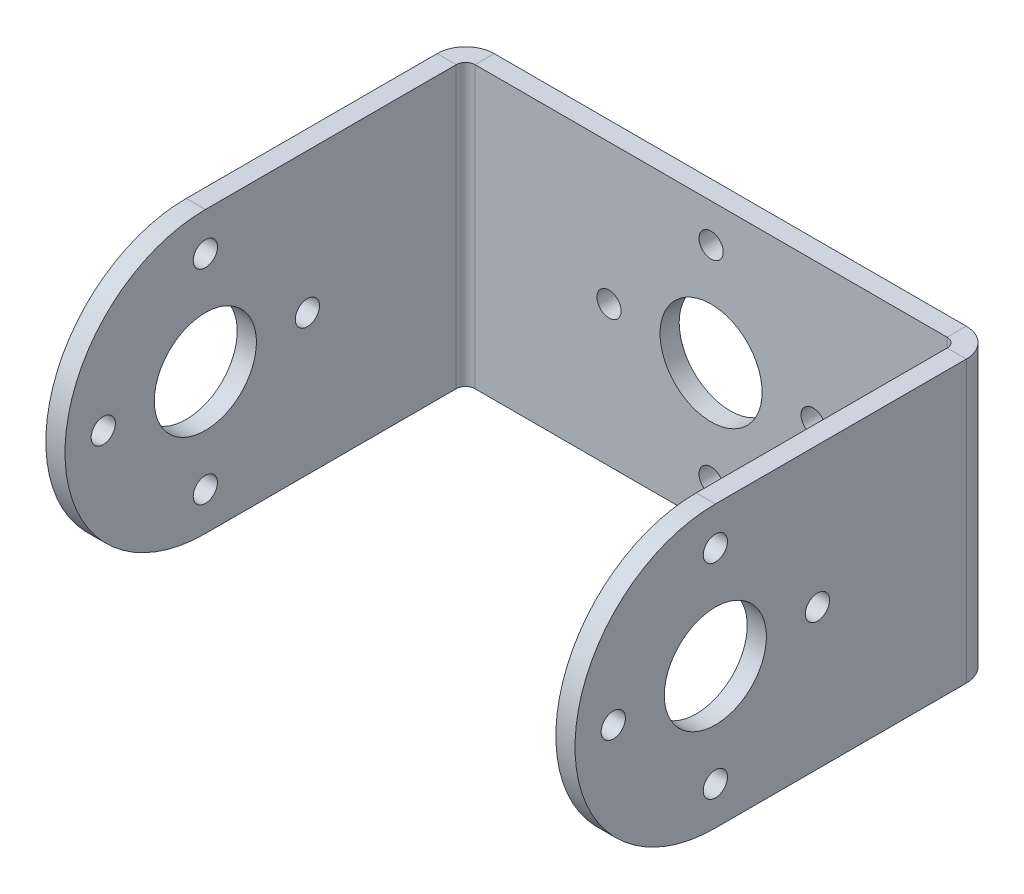
ISO-10303-21;
HEADER;
FILE_DESCRIPTION(('STEP AP214'),'2;1');
FILE_NAME('part.step','',(''),(''),'','','');
FILE_SCHEMA(('AUTOMOTIVE_DESIGN { 1 0 10303 214 1 1 1 1 }'));
ENDSEC;
DATA;
#1=APPLICATION_CONTEXT('core data for automotive mechanical design processes');
#2=APPLICATION_PROTOCOL_DEFINITION('international standard','automotive_design',2000,#1);
#3=PRODUCT_CONTEXT('',#1,'mechanical');
#4=PRODUCT('Part','Part','',(#3));
#5=PRODUCT_RELATED_PRODUCT_CATEGORY('part','',(#4));
#6=PRODUCT_DEFINITION_FORMATION('','',#4);
#7=PRODUCT_DEFINITION_CONTEXT('part definition',#1,'design');
#8=PRODUCT_DEFINITION('design','',#6,#7);
#9=PRODUCT_DEFINITION_SHAPE('','',#8);
#10=(LENGTH_UNIT() NAMED_UNIT(*) SI_UNIT(.MILLI.,.METRE.));
#11=(NAMED_UNIT(*) PLANE_ANGLE_UNIT() SI_UNIT($,.RADIAN.));
#12=(NAMED_UNIT(*) SI_UNIT($,.STERADIAN.) SOLID_ANGLE_UNIT());
#13=UNCERTAINTY_MEASURE_WITH_UNIT(LENGTH_MEASURE(1.E-05),#10,'distance_accuracy_value','');
#14=(GEOMETRIC_REPRESENTATION_CONTEXT(3) GLOBAL_UNCERTAINTY_ASSIGNED_CONTEXT((#13)) GLOBAL_UNIT_ASSIGNED_CONTEXT((#10,
#11,#12)) REPRESENTATION_CONTEXT('',''));
#15=CARTESIAN_POINT('',(0.,0.,0.));
#16=DIRECTION('',(0.,0.,1.));
#17=DIRECTION('',(1.,0.,0.));
#18=AXIS2_PLACEMENT_3D('',#15,#16,#17);
#19=CARTESIAN_POINT('',(20.7366000000001,0.,-20.0985458194133));
#20=DIRECTION('',(1.,0.,0.));
#21=DIRECTION('',(0.,0.,-1.));
#22=AXIS2_PLACEMENT_3D('',#19,#20,#21);
#23=PLANE('',#22);
#24=CARTESIAN_POINT('',(20.7366,0.,12.4014541805866));
#25=DIRECTION('',(-1.,0.,0.));
#26=DIRECTION('',(0.,0.,1.));
#27=AXIS2_PLACEMENT_3D('',#24,#25,#26);
#28=CIRCLE('',#27,0.950000000000003);
#29=CARTESIAN_POINT('',(20.7366,0.,13.3514541805866));
#30=VERTEX_POINT('',#29);
#31=EDGE_CURVE('E904',#30,#30,#28,.T.);
#32=ORIENTED_EDGE('',*,*,#31,.T.);
#33=EDGE_LOOP('',(#32));
#34=FACE_BOUND('',#33,.T.);
#35=CARTESIAN_POINT('',(20.7366000000001,0.,20.4014541805866));
#36=DIRECTION('',(-1.,0.,0.));
#37=DIRECTION('',(0.,0.,1.));
#38=AXIS2_PLACEMENT_3D('',#35,#36,#37);
#39=CIRCLE('',#38,4.);
#40=CARTESIAN_POINT('',(20.7366000000001,0.,24.4014541805866));
#41=VERTEX_POINT('',#40);
#42=EDGE_CURVE('E894',#41,#41,#39,.T.);
#43=ORIENTED_EDGE('',*,*,#42,.T.);
#44=EDGE_LOOP('',(#43));
#45=FACE_BOUND('',#44,.T.);
#46=CARTESIAN_POINT('',(20.7366000000001,0.,28.4014541805866));
#47=DIRECTION('',(-1.,0.,0.));
#48=DIRECTION('',(0.,0.,1.));
#49=AXIS2_PLACEMENT_3D('',#46,#47,#48);
#50=CIRCLE('',#49,0.950000000000004);
#51=CARTESIAN_POINT('',(20.7366000000001,0.,29.3514541805866));
#52=VERTEX_POINT('',#51);
#53=EDGE_CURVE('E888',#52,#52,#50,.T.);
#54=ORIENTED_EDGE('',*,*,#53,.T.);
#55=EDGE_LOOP('',(#54));
#56=FACE_BOUND('',#55,.T.);
#57=CARTESIAN_POINT('',(20.7366000000001,-7.99999999999997,20.4014541805866));
#58=DIRECTION('',(-1.,0.,0.));
#59=DIRECTION('',(0.,0.,1.));
#60=AXIS2_PLACEMENT_3D('',#57,#58,#59);
#61=CIRCLE('',#60,0.950000000000001);
#62=CARTESIAN_POINT('',(20.7366000000001,-7.99999999999997,21.3514541805866));
#63=VERTEX_POINT('',#62);
#64=EDGE_CURVE('E879',#63,#63,#61,.T.);
#65=ORIENTED_EDGE('',*,*,#64,.T.);
#66=EDGE_LOOP('',(#65));
#67=FACE_BOUND('',#66,.T.);
#68=CARTESIAN_POINT('',(20.7366000000001,8.00000000000003,20.4014541805866));
#69=DIRECTION('',(-1.,0.,0.));
#70=DIRECTION('',(0.,0.,1.));
#71=AXIS2_PLACEMENT_3D('',#68,#69,#70);
#72=CIRCLE('',#71,0.950000000000004);
#73=CARTESIAN_POINT('',(20.7366000000001,8.00000000000003,21.3514541805866));
#74=VERTEX_POINT('',#73);
#75=EDGE_CURVE('E873',#74,#74,#72,.T.);
#76=ORIENTED_EDGE('',*,*,#75,.T.);
#77=EDGE_LOOP('',(#76));
#78=FACE_BOUND('',#77,.T.);
#79=CARTESIAN_POINT('',(20.7365999999999,0.,20.4014541805866));
#80=DIRECTION('',(1.,0.,0.));
#81=DIRECTION('',(0.,0.,-1.));
#82=AXIS2_PLACEMENT_3D('',#79,#80,#81);
#83=CIRCLE('',#82,11.);
#84=CARTESIAN_POINT('',(20.7365999999999,11.,20.4014541805866));
#85=VERTEX_POINT('',#84);
#86=CARTESIAN_POINT('',(20.7365999999999,-11.,20.4014541805866));
#87=VERTEX_POINT('',#86);
#88=EDGE_CURVE('E229',#85,#87,#83,.T.);
#89=ORIENTED_EDGE('',*,*,#88,.T.);
#90=DIRECTION('',(0.,0.,1.));
#91=VECTOR('',#90,1.);
#92=CARTESIAN_POINT('',(20.7366000000002,-11.,-71.5985458194133));
#93=LINE('',#92,#91);
#94=CARTESIAN_POINT('',(20.7366,-11.,0.736600000000007));
#95=VERTEX_POINT('',#94);
#96=EDGE_CURVE('E233',#95,#87,#93,.T.);
#97=ORIENTED_EDGE('',*,*,#96,.F.);
#98=DIRECTION('',(0.,-1.,0.));
#99=VECTOR('',#98,1.);
#100=CARTESIAN_POINT('',(20.7366,0.,0.736600000000007));
#101=LINE('',#100,#99);
#102=CARTESIAN_POINT('',(20.7366,11.,0.736600000000007));
#103=VERTEX_POINT('',#102);
#104=EDGE_CURVE('E269',#103,#95,#101,.T.);
#105=ORIENTED_EDGE('',*,*,#104,.F.);
#106=DIRECTION('',(0.,0.,-1.));
#107=VECTOR('',#106,1.);
#108=CARTESIAN_POINT('',(20.7366000000002,11.,-71.5985458194133));
#109=LINE('',#108,#107);
#110=EDGE_CURVE('E235',#85,#103,#109,.T.);
#111=ORIENTED_EDGE('',*,*,#110,.F.);
#112=EDGE_LOOP('',(#89,#97,#105,#111));
#113=FACE_BOUND('',#112,.T.);
#114=ADVANCED_FACE('F138',(#34,#45,#56,#67,#78,#113),#23,.T.);
#115=CARTESIAN_POINT('',(19.2366000000001,0.,-20.0985458194133));
#116=DIRECTION('',(1.,0.,0.));
#117=DIRECTION('',(0.,0.,-1.));
#118=AXIS2_PLACEMENT_3D('',#115,#116,#117);
#119=PLANE('',#118);
#120=CARTESIAN_POINT('',(19.2366,0.,12.4014541805866));
#121=DIRECTION('',(-1.,0.,0.));
#122=DIRECTION('',(0.,0.,1.));
#123=AXIS2_PLACEMENT_3D('',#120,#121,#122);
#124=CIRCLE('',#123,0.950000000000003);
#125=CARTESIAN_POINT('',(19.2366,0.,13.3514541805866));
#126=VERTEX_POINT('',#125);
#127=EDGE_CURVE('E898',#126,#126,#124,.T.);
#128=ORIENTED_EDGE('',*,*,#127,.F.);
#129=EDGE_LOOP('',(#128));
#130=FACE_BOUND('',#129,.T.);
#131=CARTESIAN_POINT('',(19.2366000000001,0.,20.4014541805866));
#132=DIRECTION('',(-1.,0.,0.));
#133=DIRECTION('',(0.,0.,1.));
#134=AXIS2_PLACEMENT_3D('',#131,#132,#133);
#135=CIRCLE('',#134,4.);
#136=CARTESIAN_POINT('',(19.2366000000001,0.,24.4014541805866));
#137=VERTEX_POINT('',#136);
#138=EDGE_CURVE('E890',#137,#137,#135,.T.);
#139=ORIENTED_EDGE('',*,*,#138,.F.);
#140=EDGE_LOOP('',(#139));
#141=FACE_BOUND('',#140,.T.);
#142=CARTESIAN_POINT('',(19.2366000000001,0.,28.4014541805866));
#143=DIRECTION('',(-1.,0.,0.));
#144=DIRECTION('',(0.,0.,1.));
#145=AXIS2_PLACEMENT_3D('',#142,#143,#144);
#146=CIRCLE('',#145,0.950000000000004);
#147=CARTESIAN_POINT('',(19.2366000000001,0.,29.3514541805866));
#148=VERTEX_POINT('',#147);
#149=EDGE_CURVE('E885',#148,#148,#146,.T.);
#150=ORIENTED_EDGE('',*,*,#149,.F.);
#151=EDGE_LOOP('',(#150));
#152=FACE_BOUND('',#151,.T.);
#153=CARTESIAN_POINT('',(19.2366000000001,-7.99999999999997,20.4014541805866));
#154=DIRECTION('',(-1.,0.,0.));
#155=DIRECTION('',(0.,0.,1.));
#156=AXIS2_PLACEMENT_3D('',#153,#154,#155);
#157=CIRCLE('',#156,0.950000000000001);
#158=CARTESIAN_POINT('',(19.2366000000001,-7.99999999999997,21.3514541805866));
#159=VERTEX_POINT('',#158);
#160=EDGE_CURVE('E875',#159,#159,#157,.T.);
#161=ORIENTED_EDGE('',*,*,#160,.F.);
#162=EDGE_LOOP('',(#161));
#163=FACE_BOUND('',#162,.T.);
#164=CARTESIAN_POINT('',(19.2366000000001,8.00000000000003,20.4014541805866));
#165=DIRECTION('',(-1.,0.,0.));
#166=DIRECTION('',(0.,0.,1.));
#167=AXIS2_PLACEMENT_3D('',#164,#165,#166);
#168=CIRCLE('',#167,0.950000000000004);
#169=CARTESIAN_POINT('',(19.2366000000001,8.00000000000003,21.3514541805866));
#170=VERTEX_POINT('',#169);
#171=EDGE_CURVE('E383',#170,#170,#168,.T.);
#172=ORIENTED_EDGE('',*,*,#171,.F.);
#173=EDGE_LOOP('',(#172));
#174=FACE_BOUND('',#173,.T.);
#175=DIRECTION('',(0.,0.,1.));
#176=VECTOR('',#175,1.);
#177=CARTESIAN_POINT('',(19.2366000000002,-11.,-71.5985458194133));
#178=LINE('',#177,#176);
#179=CARTESIAN_POINT('',(19.2366,-11.,0.7366));
#180=VERTEX_POINT('',#179);
#181=CARTESIAN_POINT('',(19.2365999999999,-11.,20.4014541805866));
#182=VERTEX_POINT('',#181);
#183=EDGE_CURVE('E249',#180,#182,#178,.T.);
#184=ORIENTED_EDGE('',*,*,#183,.T.);
#185=CARTESIAN_POINT('',(19.2365999999999,0.,20.4014541805866));
#186=DIRECTION('',(1.,0.,0.));
#187=DIRECTION('',(0.,0.,-1.));
#188=AXIS2_PLACEMENT_3D('',#185,#186,#187);
#189=CIRCLE('',#188,11.);
#190=CARTESIAN_POINT('',(19.2365999999999,11.,20.4014541805866));
#191=VERTEX_POINT('',#190);
#192=EDGE_CURVE('E236',#191,#182,#189,.T.);
#193=ORIENTED_EDGE('',*,*,#192,.F.);
#194=DIRECTION('',(0.,0.,-1.));
#195=VECTOR('',#194,1.);
#196=CARTESIAN_POINT('',(19.2366000000002,11.,-71.5985458194133));
#197=LINE('',#196,#195);
#198=CARTESIAN_POINT('',(19.2366,11.,0.7366));
#199=VERTEX_POINT('',#198);
#200=EDGE_CURVE('E262',#191,#199,#197,.T.);
#201=ORIENTED_EDGE('',*,*,#200,.T.);
#202=DIRECTION('',(0.,-1.,0.));
#203=VECTOR('',#202,1.);
#204=CARTESIAN_POINT('',(19.2366,0.,0.7366));
#205=LINE('',#204,#203);
#206=EDGE_CURVE('E254',#199,#180,#205,.T.);
#207=ORIENTED_EDGE('',*,*,#206,.T.);
#208=EDGE_LOOP('',(#184,#193,#201,#207));
#209=FACE_BOUND('',#208,.T.);
#210=ADVANCED_FACE('F428',(#130,#141,#152,#163,#174,#209),#119,.F.);
#211=CARTESIAN_POINT('',(20.7366000000002,11.,-71.5985458194133));
#212=DIRECTION('',(0.,1.,0.));
#213=DIRECTION('',(-1.,0.,0.));
#214=AXIS2_PLACEMENT_3D('',#211,#212,#213);
#215=PLANE('',#214);
#216=ORIENTED_EDGE('',*,*,#200,.F.);
#217=DIRECTION('',(-1.,0.,0.));
#218=VECTOR('',#217,1.);
#219=CARTESIAN_POINT('',(19.2365999999999,11.,20.4014541805866));
#220=LINE('',#219,#218);
#221=EDGE_CURVE('E155',#191,#85,#220,.F.);
#222=ORIENTED_EDGE('',*,*,#221,.T.);
#223=ORIENTED_EDGE('',*,*,#110,.T.);
#224=DIRECTION('',(1.,0.,0.));
#225=VECTOR('',#224,1.);
#226=CARTESIAN_POINT('',(20.7366,11.,0.736600000000007));
#227=LINE('',#226,#225);
#228=EDGE_CURVE('E265',#199,#103,#227,.T.);
#229=ORIENTED_EDGE('',*,*,#228,.F.);
#230=EDGE_LOOP('',(#216,#222,#223,#229));
#231=FACE_BOUND('',#230,.T.);
#232=ADVANCED_FACE('F419',(#231),#215,.T.);
#233=CARTESIAN_POINT('',(-20.7366000000001,0.,-20.0985458194133));
#234=DIRECTION('',(-1.,0.,0.));
#235=DIRECTION('',(0.,0.,1.));
#236=AXIS2_PLACEMENT_3D('',#233,#234,#235);
#237=PLANE('',#236);
#238=CARTESIAN_POINT('',(-20.7365999999999,-7.99999999999999,20.4014541805867));
#239=DIRECTION('',(-1.,0.,0.));
#240=DIRECTION('',(0.,0.,1.));
#241=AXIS2_PLACEMENT_3D('',#238,#239,#240);
#242=CIRCLE('',#241,0.950000000000001);
#243=CARTESIAN_POINT('',(-20.7365999999999,-7.99999999999999,21.3514541805867));
#244=VERTEX_POINT('',#243);
#245=EDGE_CURVE('E391',#244,#244,#242,.T.);
#246=ORIENTED_EDGE('',*,*,#245,.F.);
#247=EDGE_LOOP('',(#246));
#248=FACE_BOUND('',#247,.T.);
#249=CARTESIAN_POINT('',(-20.7365999999999,0.,28.4014541805867));
#250=DIRECTION('',(-1.,0.,0.));
#251=DIRECTION('',(0.,0.,1.));
#252=AXIS2_PLACEMENT_3D('',#249,#250,#251);
#253=CIRCLE('',#252,0.950000000000004);
#254=CARTESIAN_POINT('',(-20.7365999999999,0.,29.3514541805867));
#255=VERTEX_POINT('',#254);
#256=EDGE_CURVE('E397',#255,#255,#253,.T.);
#257=ORIENTED_EDGE('',*,*,#256,.F.);
#258=EDGE_LOOP('',(#257));
#259=FACE_BOUND('',#258,.T.);
#260=CARTESIAN_POINT('',(-20.7365999999999,0.,20.4014541805867));
#261=DIRECTION('',(-1.,0.,0.));
#262=DIRECTION('',(0.,0.,1.));
#263=AXIS2_PLACEMENT_3D('',#260,#261,#262);
#264=CIRCLE('',#263,4.);
#265=CARTESIAN_POINT('',(-20.7365999999999,0.,24.4014541805867));
#266=VERTEX_POINT('',#265);
#267=EDGE_CURVE('E403',#266,#266,#264,.T.);
#268=ORIENTED_EDGE('',*,*,#267,.F.);
#269=EDGE_LOOP('',(#268));
#270=FACE_BOUND('',#269,.T.);
#271=CARTESIAN_POINT('',(-20.7366,0.,12.4014541805867));
#272=DIRECTION('',(-1.,0.,0.));
#273=DIRECTION('',(0.,0.,1.));
#274=AXIS2_PLACEMENT_3D('',#271,#272,#273);
#275=CIRCLE('',#274,0.950000000000003);
#276=CARTESIAN_POINT('',(-20.7365999999999,0.,13.3514541805867));
#277=VERTEX_POINT('',#276);
#278=EDGE_CURVE('E387',#277,#277,#275,.T.);
#279=ORIENTED_EDGE('',*,*,#278,.F.);
#280=EDGE_LOOP('',(#279));
#281=FACE_BOUND('',#280,.T.);
#282=CARTESIAN_POINT('',(-20.7365999999999,8.00000000000001,20.4014541805867));
#283=DIRECTION('',(-1.,0.,0.));
#284=DIRECTION('',(0.,0.,1.));
#285=AXIS2_PLACEMENT_3D('',#282,#283,#284);
#286=CIRCLE('',#285,0.950000000000004);
#287=CARTESIAN_POINT('',(-20.7365999999999,8.00000000000001,21.3514541805867));
#288=VERTEX_POINT('',#287);
#289=EDGE_CURVE('E257',#288,#288,#286,.T.);
#290=ORIENTED_EDGE('',*,*,#289,.F.);
#291=EDGE_LOOP('',(#290));
#292=FACE_BOUND('',#291,.T.);
#293=CARTESIAN_POINT('',(-20.7365999999999,0.,20.4014541805867));
#294=DIRECTION('',(-1.,0.,0.));
#295=DIRECTION('',(0.,0.,1.));
#296=AXIS2_PLACEMENT_3D('',#293,#294,#295);
#297=CIRCLE('',#296,11.);
#298=CARTESIAN_POINT('',(-20.7365999999999,-11.,20.4014541805867));
#299=VERTEX_POINT('',#298);
#300=CARTESIAN_POINT('',(-20.7365999999999,11.,20.4014541805867));
#301=VERTEX_POINT('',#300);
#302=EDGE_CURVE('E366',#299,#301,#297,.T.);
#303=ORIENTED_EDGE('',*,*,#302,.T.);
#304=DIRECTION('',(0.,0.,1.));
#305=VECTOR('',#304,1.);
#306=CARTESIAN_POINT('',(-20.7365999999999,11.,31.4014541805867));
#307=LINE('',#306,#305);
#308=CARTESIAN_POINT('',(-20.7366,11.,0.736600000000007));
#309=VERTEX_POINT('',#308);
#310=EDGE_CURVE('E281',#309,#301,#307,.T.);
#311=ORIENTED_EDGE('',*,*,#310,.F.);
#312=DIRECTION('',(0.,-1.,0.));
#313=VECTOR('',#312,1.);
#314=CARTESIAN_POINT('',(-20.7366,0.,0.736600000000007));
#315=LINE('',#314,#313);
#316=CARTESIAN_POINT('',(-20.7366,-11.,0.736600000000007));
#317=VERTEX_POINT('',#316);
#318=EDGE_CURVE('E297',#309,#317,#315,.T.);
#319=ORIENTED_EDGE('',*,*,#318,.T.);
#320=DIRECTION('',(0.,0.,-1.));
#321=VECTOR('',#320,1.);
#322=CARTESIAN_POINT('',(-20.7365999999999,-11.,31.4014541805867));
#323=LINE('',#322,#321);
#324=EDGE_CURVE('E295',#299,#317,#323,.T.);
#325=ORIENTED_EDGE('',*,*,#324,.F.);
#326=EDGE_LOOP('',(#303,#311,#319,#325));
#327=FACE_BOUND('',#326,.T.);
#328=ADVANCED_FACE('F363',(#248,#259,#270,#281,#292,#327),#237,.T.);
#329=CARTESIAN_POINT('',(-19.2366000000001,0.,-20.0985458194133));
#330=DIRECTION('',(-1.,0.,0.));
#331=DIRECTION('',(0.,0.,1.));
#332=AXIS2_PLACEMENT_3D('',#329,#330,#331);
#333=PLANE('',#332);
#334=CARTESIAN_POINT('',(-19.2365999999999,-7.99999999999999,20.4014541805867));
#335=DIRECTION('',(-1.,0.,0.));
#336=DIRECTION('',(0.,0.,1.));
#337=AXIS2_PLACEMENT_3D('',#334,#335,#336);
#338=CIRCLE('',#337,0.950000000000001);
#339=CARTESIAN_POINT('',(-19.2365999999999,-7.99999999999999,21.3514541805867));
#340=VERTEX_POINT('',#339);
#341=EDGE_CURVE('E388',#340,#340,#338,.T.);
#342=ORIENTED_EDGE('',*,*,#341,.T.);
#343=EDGE_LOOP('',(#342));
#344=FACE_BOUND('',#343,.T.);
#345=CARTESIAN_POINT('',(-19.2365999999999,0.,28.4014541805867));
#346=DIRECTION('',(-1.,0.,0.));
#347=DIRECTION('',(0.,0.,1.));
#348=AXIS2_PLACEMENT_3D('',#345,#346,#347);
#349=CIRCLE('',#348,0.950000000000004);
#350=CARTESIAN_POINT('',(-19.2365999999999,0.,29.3514541805867));
#351=VERTEX_POINT('',#350);
#352=EDGE_CURVE('E394',#351,#351,#349,.T.);
#353=ORIENTED_EDGE('',*,*,#352,.T.);
#354=EDGE_LOOP('',(#353));
#355=FACE_BOUND('',#354,.T.);
#356=CARTESIAN_POINT('',(-19.2365999999999,0.,20.4014541805867));
#357=DIRECTION('',(-1.,0.,0.));
#358=DIRECTION('',(0.,0.,1.));
#359=AXIS2_PLACEMENT_3D('',#356,#357,#358);
#360=CIRCLE('',#359,4.);
#361=CARTESIAN_POINT('',(-19.2365999999999,0.,24.4014541805867));
#362=VERTEX_POINT('',#361);
#363=EDGE_CURVE('E400',#362,#362,#360,.T.);
#364=ORIENTED_EDGE('',*,*,#363,.T.);
#365=EDGE_LOOP('',(#364));
#366=FACE_BOUND('',#365,.T.);
#367=CARTESIAN_POINT('',(-19.2365999999999,0.,12.4014541805867));
#368=DIRECTION('',(-1.,0.,0.));
#369=DIRECTION('',(0.,0.,1.));
#370=AXIS2_PLACEMENT_3D('',#367,#368,#369);
#371=CIRCLE('',#370,0.950000000000003);
#372=CARTESIAN_POINT('',(-19.2365999999999,0.,13.3514541805867));
#373=VERTEX_POINT('',#372);
#374=EDGE_CURVE('E406',#373,#373,#371,.T.);
#375=ORIENTED_EDGE('',*,*,#374,.T.);
#376=EDGE_LOOP('',(#375));
#377=FACE_BOUND('',#376,.T.);
#378=CARTESIAN_POINT('',(-19.2365999999999,8.00000000000001,20.4014541805867));
#379=DIRECTION('',(-1.,0.,0.));
#380=DIRECTION('',(0.,0.,1.));
#381=AXIS2_PLACEMENT_3D('',#378,#379,#380);
#382=CIRCLE('',#381,0.950000000000004);
#383=CARTESIAN_POINT('',(-19.2365999999999,8.00000000000001,21.3514541805867));
#384=VERTEX_POINT('',#383);
#385=EDGE_CURVE('E271',#384,#384,#382,.T.);
#386=ORIENTED_EDGE('',*,*,#385,.T.);
#387=EDGE_LOOP('',(#386));
#388=FACE_BOUND('',#387,.T.);
#389=DIRECTION('',(0.,0.,1.));
#390=VECTOR('',#389,1.);
#391=CARTESIAN_POINT('',(-19.2365999999999,11.,31.4014541805867));
#392=LINE('',#391,#390);
#393=CARTESIAN_POINT('',(-19.2366,11.,0.7366));
#394=VERTEX_POINT('',#393);
#395=CARTESIAN_POINT('',(-19.2365999999999,11.,20.4014541805867));
#396=VERTEX_POINT('',#395);
#397=EDGE_CURVE('E289',#394,#396,#392,.T.);
#398=ORIENTED_EDGE('',*,*,#397,.T.);
#399=CARTESIAN_POINT('',(-19.2365999999999,0.,20.4014541805867));
#400=DIRECTION('',(-1.,0.,0.));
#401=DIRECTION('',(0.,0.,1.));
#402=AXIS2_PLACEMENT_3D('',#399,#400,#401);
#403=CIRCLE('',#402,11.);
#404=CARTESIAN_POINT('',(-19.2365999999999,-11.,20.4014541805867));
#405=VERTEX_POINT('',#404);
#406=EDGE_CURVE('E379',#405,#396,#403,.T.);
#407=ORIENTED_EDGE('',*,*,#406,.F.);
#408=DIRECTION('',(0.,0.,-1.));
#409=VECTOR('',#408,1.);
#410=CARTESIAN_POINT('',(-19.2365999999999,-11.,31.4014541805867));
#411=LINE('',#410,#409);
#412=CARTESIAN_POINT('',(-19.2366,-11.,0.7366));
#413=VERTEX_POINT('',#412);
#414=EDGE_CURVE('E287',#405,#413,#411,.T.);
#415=ORIENTED_EDGE('',*,*,#414,.T.);
#416=DIRECTION('',(0.,-1.,0.));
#417=VECTOR('',#416,1.);
#418=CARTESIAN_POINT('',(-19.2366,0.,0.7366));
#419=LINE('',#418,#417);
#420=EDGE_CURVE('E278',#394,#413,#419,.T.);
#421=ORIENTED_EDGE('',*,*,#420,.F.);
#422=EDGE_LOOP('',(#398,#407,#415,#421));
#423=FACE_BOUND('',#422,.T.);
#424=ADVANCED_FACE('F378',(#344,#355,#366,#377,#388,#423),#333,.F.);
#425=CARTESIAN_POINT('',(-20.7365999999999,-11.,31.4014541805867));
#426=DIRECTION('',(0.,-1.,0.));
#427=DIRECTION('',(-1.,0.,0.));
#428=AXIS2_PLACEMENT_3D('',#425,#426,#427);
#429=PLANE('',#428);
#430=ORIENTED_EDGE('',*,*,#414,.F.);
#431=DIRECTION('',(1.,0.,0.));
#432=VECTOR('',#431,1.);
#433=CARTESIAN_POINT('',(-19.2365999999999,-11.,20.4014541805867));
#434=LINE('',#433,#432);
#435=EDGE_CURVE('E163',#405,#299,#434,.F.);
#436=ORIENTED_EDGE('',*,*,#435,.T.);
#437=ORIENTED_EDGE('',*,*,#324,.T.);
#438=DIRECTION('',(1.,0.,0.));
#439=VECTOR('',#438,1.);
#440=CARTESIAN_POINT('',(-20.7366,-11.,0.736600000000007));
#441=LINE('',#440,#439);
#442=EDGE_CURVE('E292',#317,#413,#441,.T.);
#443=ORIENTED_EDGE('',*,*,#442,.T.);
#444=EDGE_LOOP('',(#430,#436,#437,#443));
#445=FACE_BOUND('',#444,.T.);
#446=ADVANCED_FACE('F376',(#445),#429,.T.);
#447=CARTESIAN_POINT('',(0.,0.,-1.5));
#448=DIRECTION('',(0.,0.,-1.));
#449=DIRECTION('',(-1.,0.,0.));
#450=AXIS2_PLACEMENT_3D('',#447,#448,#449);
#451=PLANE('',#450);
#452=CARTESIAN_POINT('',(-7.99999999999977,-2.27373675443232E-13,-1.5));
#453=DIRECTION('',(0.,0.,-1.));
#454=DIRECTION('',(-1.,0.,0.));
#455=AXIS2_PLACEMENT_3D('',#452,#453,#454);
#456=CIRCLE('',#455,0.950000000000363);
#457=CARTESIAN_POINT('',(-8.95000000000014,-2.27373675443232E-13,-1.5));
#458=VERTEX_POINT('',#457);
#459=EDGE_CURVE('E924',#458,#458,#456,.T.);
#460=ORIENTED_EDGE('',*,*,#459,.F.);
#461=EDGE_LOOP('',(#460));
#462=FACE_BOUND('',#461,.T.);
#463=CARTESIAN_POINT('',(4.52787916007828E-13,-8.,-1.5));
#464=DIRECTION('',(0.,0.,-1.));
#465=DIRECTION('',(-1.,0.,0.));
#466=AXIS2_PLACEMENT_3D('',#463,#464,#465);
#467=CIRCLE('',#466,0.950000000000486);
#468=CARTESIAN_POINT('',(-0.950000000000033,-8.,-1.5));
#469=VERTEX_POINT('',#468);
#470=EDGE_CURVE('E927',#469,#469,#467,.T.);
#471=ORIENTED_EDGE('',*,*,#470,.F.);
#472=EDGE_LOOP('',(#471));
#473=FACE_BOUND('',#472,.T.);
#474=CARTESIAN_POINT('',(8.00000000000023,2.26393958003914E-13,-1.5));
#475=DIRECTION('',(0.,0.,-1.));
#476=DIRECTION('',(-1.,0.,0.));
#477=AXIS2_PLACEMENT_3D('',#474,#475,#476);
#478=CIRCLE('',#477,0.950000000000177);
#479=CARTESIAN_POINT('',(7.05000000000005,2.26393958003914E-13,-1.5));
#480=VERTEX_POINT('',#479);
#481=EDGE_CURVE('E930',#480,#480,#478,.T.);
#482=ORIENTED_EDGE('',*,*,#481,.F.);
#483=EDGE_LOOP('',(#482));
#484=FACE_BOUND('',#483,.T.);
#485=CARTESIAN_POINT('',(0.,8.,-1.5));
#486=DIRECTION('',(0.,0.,-1.));
#487=DIRECTION('',(-1.,0.,0.));
#488=AXIS2_PLACEMENT_3D('',#485,#486,#487);
#489=CIRCLE('',#488,0.95);
#490=CARTESIAN_POINT('',(-0.95,8.,-1.5));
#491=VERTEX_POINT('',#490);
#492=EDGE_CURVE('E933',#491,#491,#489,.T.);
#493=ORIENTED_EDGE('',*,*,#492,.F.);
#494=EDGE_LOOP('',(#493));
#495=FACE_BOUND('',#494,.T.);
#496=CARTESIAN_POINT('',(0.,0.,-1.5));
#497=DIRECTION('',(0.,0.,-1.));
#498=DIRECTION('',(-1.,0.,0.));
#499=AXIS2_PLACEMENT_3D('',#496,#497,#498);
#500=CIRCLE('',#499,4.);
#501=CARTESIAN_POINT('',(-4.,0.,-1.5));
#502=VERTEX_POINT('',#501);
#503=EDGE_CURVE('E243',#502,#502,#500,.T.);
#504=ORIENTED_EDGE('',*,*,#503,.F.);
#505=EDGE_LOOP('',(#504));
#506=FACE_BOUND('',#505,.T.);
#507=DIRECTION('',(-1.,0.,0.));
#508=VECTOR('',#507,1.);
#509=CARTESIAN_POINT('',(-51.5,11.,-1.5));
#510=LINE('',#509,#508);
#511=CARTESIAN_POINT('',(18.5,11.,-1.5));
#512=VERTEX_POINT('',#511);
#513=CARTESIAN_POINT('',(-18.5,11.,-1.5));
#514=VERTEX_POINT('',#513);
#515=EDGE_CURVE('E142',#512,#514,#510,.T.);
#516=ORIENTED_EDGE('',*,*,#515,.F.);
#517=DIRECTION('',(0.,-1.,0.));
#518=VECTOR('',#517,1.);
#519=CARTESIAN_POINT('',(18.5,0.,-1.5));
#520=LINE('',#519,#518);
#521=CARTESIAN_POINT('',(18.5,-11.,-1.5));
#522=VERTEX_POINT('',#521);
#523=EDGE_CURVE('E327',#512,#522,#520,.T.);
#524=ORIENTED_EDGE('',*,*,#523,.T.);
#525=DIRECTION('',(1.,0.,0.));
#526=VECTOR('',#525,1.);
#527=CARTESIAN_POINT('',(-51.5,-11.,-1.5));
#528=LINE('',#527,#526);
#529=CARTESIAN_POINT('',(-18.5,-11.,-1.5));
#530=VERTEX_POINT('',#529);
#531=EDGE_CURVE('E318',#530,#522,#528,.T.);
#532=ORIENTED_EDGE('',*,*,#531,.F.);
#533=DIRECTION('',(0.,-1.,0.));
#534=VECTOR('',#533,1.);
#535=CARTESIAN_POINT('',(-18.5,0.,-1.5));
#536=LINE('',#535,#534);
#537=EDGE_CURVE('E314',#514,#530,#536,.T.);
#538=ORIENTED_EDGE('',*,*,#537,.F.);
#539=EDGE_LOOP('',(#516,#524,#532,#538));
#540=FACE_BOUND('',#539,.T.);
#541=ADVANCED_FACE('F477',(#462,#473,#484,#495,#506,#540),#451,.T.);
#542=CARTESIAN_POINT('',(-51.5,11.,-1.5));
#543=DIRECTION('',(0.,1.,0.));
#544=DIRECTION('',(0.,0.,1.));
#545=AXIS2_PLACEMENT_3D('',#542,#543,#544);
#546=PLANE('',#545);
#547=DIRECTION('',(-1.,0.,0.));
#548=VECTOR('',#547,1.);
#549=CARTESIAN_POINT('',(-51.5,11.,0.));
#550=LINE('',#549,#548);
#551=CARTESIAN_POINT('',(18.5,11.,0.));
#552=VERTEX_POINT('',#551);
#553=CARTESIAN_POINT('',(-18.5,11.,0.));
#554=VERTEX_POINT('',#553);
#555=EDGE_CURVE('E309',#552,#554,#550,.T.);
#556=ORIENTED_EDGE('',*,*,#555,.F.);
#557=DIRECTION('',(0.,0.,-1.));
#558=VECTOR('',#557,1.);
#559=CARTESIAN_POINT('',(18.5,11.,-1.5));
#560=LINE('',#559,#558);
#561=EDGE_CURVE('E330',#552,#512,#560,.T.);
#562=ORIENTED_EDGE('',*,*,#561,.T.);
#563=ORIENTED_EDGE('',*,*,#515,.T.);
#564=DIRECTION('',(0.,0.,-1.));
#565=VECTOR('',#564,1.);
#566=CARTESIAN_POINT('',(-18.5,11.,-1.5));
#567=LINE('',#566,#565);
#568=EDGE_CURVE('E324',#554,#514,#567,.T.);
#569=ORIENTED_EDGE('',*,*,#568,.F.);
#570=EDGE_LOOP('',(#556,#562,#563,#569));
#571=FACE_BOUND('',#570,.T.);
#572=ADVANCED_FACE('F346',(#571),#546,.T.);
#573=CARTESIAN_POINT('',(-51.5,-11.,-1.5));
#574=DIRECTION('',(0.,-1.,0.));
#575=DIRECTION('',(0.,0.,-1.));
#576=AXIS2_PLACEMENT_3D('',#573,#574,#575);
#577=PLANE('',#576);
#578=ORIENTED_EDGE('',*,*,#531,.T.);
#579=DIRECTION('',(0.,0.,1.));
#580=VECTOR('',#579,1.);
#581=CARTESIAN_POINT('',(18.5,-11.,-1.5));
#582=LINE('',#581,#580);
#583=CARTESIAN_POINT('',(18.5,-11.,0.));
#584=VERTEX_POINT('',#583);
#585=EDGE_CURVE('E12',#522,#584,#582,.T.);
#586=ORIENTED_EDGE('',*,*,#585,.T.);
#587=DIRECTION('',(1.,0.,0.));
#588=VECTOR('',#587,1.);
#589=CARTESIAN_POINT('',(-51.5,-11.,0.));
#590=LINE('',#589,#588);
#591=CARTESIAN_POINT('',(-18.5,-11.,0.));
#592=VERTEX_POINT('',#591);
#593=EDGE_CURVE('E336',#592,#584,#590,.T.);
#594=ORIENTED_EDGE('',*,*,#593,.F.);
#595=DIRECTION('',(0.,0.,1.));
#596=VECTOR('',#595,1.);
#597=CARTESIAN_POINT('',(-18.5,-11.,-1.5));
#598=LINE('',#597,#596);
#599=EDGE_CURVE('E317',#530,#592,#598,.T.);
#600=ORIENTED_EDGE('',*,*,#599,.F.);
#601=EDGE_LOOP('',(#578,#586,#594,#600));
#602=FACE_BOUND('',#601,.T.);
#603=ADVANCED_FACE('F140',(#602),#577,.T.);
#604=CARTESIAN_POINT('',(0.,0.,0.));
#605=DIRECTION('',(0.,0.,-1.));
#606=DIRECTION('',(-1.,0.,0.));
#607=AXIS2_PLACEMENT_3D('',#604,#605,#606);
#608=PLANE('',#607);
#609=CARTESIAN_POINT('',(-7.99999999999977,-2.27373675443232E-13,0.));
#610=DIRECTION('',(0.,0.,1.));
#611=DIRECTION('',(1.,0.,0.));
#612=AXIS2_PLACEMENT_3D('',#609,#610,#611);
#613=CIRCLE('',#612,0.950000000000363);
#614=CARTESIAN_POINT('',(-7.04999999999941,-2.27373675443232E-13,0.));
#615=VERTEX_POINT('',#614);
#616=EDGE_CURVE('E943',#615,#615,#613,.T.);
#617=ORIENTED_EDGE('',*,*,#616,.F.);
#618=EDGE_LOOP('',(#617));
#619=FACE_BOUND('',#618,.T.);
#620=CARTESIAN_POINT('',(4.52787916007828E-13,-8.,0.));
#621=DIRECTION('',(0.,0.,1.));
#622=DIRECTION('',(1.,0.,0.));
#623=AXIS2_PLACEMENT_3D('',#620,#621,#622);
#624=CIRCLE('',#623,0.950000000000486);
#625=CARTESIAN_POINT('',(0.950000000000939,-8.,0.));
#626=VERTEX_POINT('',#625);
#627=EDGE_CURVE('E940',#626,#626,#624,.T.);
#628=ORIENTED_EDGE('',*,*,#627,.F.);
#629=EDGE_LOOP('',(#628));
#630=FACE_BOUND('',#629,.T.);
#631=CARTESIAN_POINT('',(8.00000000000023,2.26393958003914E-13,0.));
#632=DIRECTION('',(0.,0.,1.));
#633=DIRECTION('',(1.,0.,0.));
#634=AXIS2_PLACEMENT_3D('',#631,#632,#633);
#635=CIRCLE('',#634,0.950000000000177);
#636=CARTESIAN_POINT('',(8.9500000000004,2.26393958003914E-13,0.));
#637=VERTEX_POINT('',#636);
#638=EDGE_CURVE('E937',#637,#637,#635,.T.);
#639=ORIENTED_EDGE('',*,*,#638,.F.);
#640=EDGE_LOOP('',(#639));
#641=FACE_BOUND('',#640,.T.);
#642=CARTESIAN_POINT('',(0.,8.,0.));
#643=DIRECTION('',(0.,0.,1.));
#644=DIRECTION('',(1.,0.,0.));
#645=AXIS2_PLACEMENT_3D('',#642,#643,#644);
#646=CIRCLE('',#645,0.95);
#647=CARTESIAN_POINT('',(0.95,8.,0.));
#648=VERTEX_POINT('',#647);
#649=EDGE_CURVE('E936',#648,#648,#646,.T.);
#650=ORIENTED_EDGE('',*,*,#649,.F.);
#651=EDGE_LOOP('',(#650));
#652=FACE_BOUND('',#651,.T.);
#653=CARTESIAN_POINT('',(0.,0.,0.));
#654=DIRECTION('',(0.,0.,1.));
#655=DIRECTION('',(1.,0.,0.));
#656=AXIS2_PLACEMENT_3D('',#653,#654,#655);
#657=CIRCLE('',#656,4.);
#658=CARTESIAN_POINT('',(4.,0.,0.));
#659=VERTEX_POINT('',#658);
#660=EDGE_CURVE('E921',#659,#659,#657,.T.);
#661=ORIENTED_EDGE('',*,*,#660,.F.);
#662=EDGE_LOOP('',(#661));
#663=FACE_BOUND('',#662,.T.);
#664=DIRECTION('',(0.,-1.,0.));
#665=VECTOR('',#664,1.);
#666=CARTESIAN_POINT('',(18.5,0.,0.));
#667=LINE('',#666,#665);
#668=EDGE_CURVE('E147',#552,#584,#667,.T.);
#669=ORIENTED_EDGE('',*,*,#668,.F.);
#670=ORIENTED_EDGE('',*,*,#555,.T.);
#671=DIRECTION('',(0.,-1.,0.));
#672=VECTOR('',#671,1.);
#673=CARTESIAN_POINT('',(-18.5,0.,0.));
#674=LINE('',#673,#672);
#675=EDGE_CURVE('E321',#554,#592,#674,.T.);
#676=ORIENTED_EDGE('',*,*,#675,.T.);
#677=ORIENTED_EDGE('',*,*,#593,.T.);
#678=EDGE_LOOP('',(#669,#670,#676,#677));
#679=FACE_BOUND('',#678,.T.);
#680=ADVANCED_FACE('F342',(#619,#630,#641,#652,#663,#679),#608,.F.);
#681=CARTESIAN_POINT('',(-18.5,11.,0.7366));
#682=DIRECTION('',(0.,1.,0.));
#683=DIRECTION('',(0.,0.,1.));
#684=AXIS2_PLACEMENT_3D('',#681,#682,#683);
#685=PLANE('',#684);
#686=DIRECTION('',(-1.,0.,0.));
#687=VECTOR('',#686,1.);
#688=CARTESIAN_POINT('',(-20.7366,11.,0.736600000000007));
#689=LINE('',#688,#687);
#690=EDGE_CURVE('E285',#394,#309,#689,.T.);
#691=ORIENTED_EDGE('',*,*,#690,.F.);
#692=CARTESIAN_POINT('',(-18.5,11.,0.7366));
#693=DIRECTION('',(0.,1.,0.));
#694=DIRECTION('',(0.,0.,1.));
#695=AXIS2_PLACEMENT_3D('',#692,#693,#694);
#696=CIRCLE('',#695,0.7366);
#697=EDGE_CURVE('E284',#394,#554,#696,.F.);
#698=ORIENTED_EDGE('',*,*,#697,.T.);
#699=ORIENTED_EDGE('',*,*,#568,.T.);
#700=CARTESIAN_POINT('',(-18.5,11.,0.7366));
#701=DIRECTION('',(0.,-1.,0.));
#702=DIRECTION('',(0.,0.,1.));
#703=AXIS2_PLACEMENT_3D('',#700,#701,#702);
#704=CIRCLE('',#703,2.2366);
#705=EDGE_CURVE('E302',#309,#514,#704,.T.);
#706=ORIENTED_EDGE('',*,*,#705,.F.);
#707=EDGE_LOOP('',(#691,#698,#699,#706));
#708=FACE_BOUND('',#707,.T.);
#709=ADVANCED_FACE('F355',(#708),#685,.T.);
#710=CARTESIAN_POINT('',(-18.5,-11.,0.7366));
#711=DIRECTION('',(0.,-1.,0.));
#712=DIRECTION('',(0.,0.,-1.));
#713=AXIS2_PLACEMENT_3D('',#710,#711,#712);
#714=PLANE('',#713);
#715=CARTESIAN_POINT('',(-18.5,-11.,0.7366));
#716=DIRECTION('',(0.,1.,0.));
#717=DIRECTION('',(0.,0.,1.));
#718=AXIS2_PLACEMENT_3D('',#715,#716,#717);
#719=CIRCLE('',#718,0.7366);
#720=EDGE_CURVE('E306',#592,#413,#719,.T.);
#721=ORIENTED_EDGE('',*,*,#720,.T.);
#722=ORIENTED_EDGE('',*,*,#442,.F.);
#723=CARTESIAN_POINT('',(-18.5,-11.,0.7366));
#724=DIRECTION('',(0.,1.,0.));
#725=DIRECTION('',(0.,0.,-1.));
#726=AXIS2_PLACEMENT_3D('',#723,#724,#725);
#727=CIRCLE('',#726,2.2366);
#728=EDGE_CURVE('E305',#530,#317,#727,.T.);
#729=ORIENTED_EDGE('',*,*,#728,.F.);
#730=ORIENTED_EDGE('',*,*,#599,.T.);
#731=EDGE_LOOP('',(#721,#722,#729,#730));
#732=FACE_BOUND('',#731,.T.);
#733=ADVANCED_FACE('F372',(#732),#714,.T.);
#734=CARTESIAN_POINT('',(-18.5,-22.174374985508,0.7366));
#735=DIRECTION('',(0.,1.,0.));
#736=DIRECTION('',(0.,0.,1.));
#737=AXIS2_PLACEMENT_3D('',#734,#735,#736);
#738=CYLINDRICAL_SURFACE('',#737,2.2366);
#739=ORIENTED_EDGE('',*,*,#537,.T.);
#740=ORIENTED_EDGE('',*,*,#728,.T.);
#741=ORIENTED_EDGE('',*,*,#318,.F.);
#742=ORIENTED_EDGE('',*,*,#705,.T.);
#743=EDGE_LOOP('',(#739,#740,#741,#742));
#744=FACE_BOUND('',#743,.T.);
#745=ADVANCED_FACE('F369',(#744),#738,.T.);
#746=CARTESIAN_POINT('',(-18.5,-22.174374985508,0.7366));
#747=DIRECTION('',(0.,1.,0.));
#748=DIRECTION('',(0.,0.,1.));
#749=AXIS2_PLACEMENT_3D('',#746,#747,#748);
#750=CYLINDRICAL_SURFACE('',#749,0.7366);
#751=ORIENTED_EDGE('',*,*,#675,.F.);
#752=ORIENTED_EDGE('',*,*,#697,.F.);
#753=ORIENTED_EDGE('',*,*,#420,.T.);
#754=ORIENTED_EDGE('',*,*,#720,.F.);
#755=EDGE_LOOP('',(#751,#752,#753,#754));
#756=FACE_BOUND('',#755,.T.);
#757=ADVANCED_FACE('F353',(#756),#750,.F.);
#758=CARTESIAN_POINT('',(-20.7365999999999,11.,31.4014541805867));
#759=DIRECTION('',(0.,1.,0.));
#760=DIRECTION('',(1.,0.,0.));
#761=AXIS2_PLACEMENT_3D('',#758,#759,#760);
#762=PLANE('',#761);
#763=DIRECTION('',(1.,0.,0.));
#764=VECTOR('',#763,1.);
#765=CARTESIAN_POINT('',(-19.2365999999999,11.,20.4014541805867));
#766=LINE('',#765,#764);
#767=EDGE_CURVE('E380',#396,#301,#766,.F.);
#768=ORIENTED_EDGE('',*,*,#767,.F.);
#769=ORIENTED_EDGE('',*,*,#397,.F.);
#770=ORIENTED_EDGE('',*,*,#690,.T.);
#771=ORIENTED_EDGE('',*,*,#310,.T.);
#772=EDGE_LOOP('',(#768,#769,#770,#771));
#773=FACE_BOUND('',#772,.T.);
#774=ADVANCED_FACE('F359',(#773),#762,.T.);
#775=CARTESIAN_POINT('',(18.5,11.,0.7366));
#776=DIRECTION('',(0.,1.,0.));
#777=DIRECTION('',(0.,0.,1.));
#778=AXIS2_PLACEMENT_3D('',#775,#776,#777);
#779=PLANE('',#778);
#780=ORIENTED_EDGE('',*,*,#561,.F.);
#781=CARTESIAN_POINT('',(18.5,11.,0.7366));
#782=DIRECTION('',(0.,-1.,0.));
#783=DIRECTION('',(0.,0.,-1.));
#784=AXIS2_PLACEMENT_3D('',#781,#782,#783);
#785=CIRCLE('',#784,0.7366);
#786=EDGE_CURVE('E248',#552,#199,#785,.T.);
#787=ORIENTED_EDGE('',*,*,#786,.T.);
#788=ORIENTED_EDGE('',*,*,#228,.T.);
#789=CARTESIAN_POINT('',(18.5,11.,0.7366));
#790=DIRECTION('',(0.,-1.,0.));
#791=DIRECTION('',(0.,0.,1.));
#792=AXIS2_PLACEMENT_3D('',#789,#790,#791);
#793=CIRCLE('',#792,2.2366);
#794=EDGE_CURVE('E272',#512,#103,#793,.T.);
#795=ORIENTED_EDGE('',*,*,#794,.F.);
#796=EDGE_LOOP('',(#780,#787,#788,#795));
#797=FACE_BOUND('',#796,.T.);
#798=ADVANCED_FACE('F460',(#797),#779,.T.);
#799=CARTESIAN_POINT('',(18.5,-11.,0.7366));
#800=DIRECTION('',(0.,-1.,0.));
#801=DIRECTION('',(0.,0.,-1.));
#802=AXIS2_PLACEMENT_3D('',#799,#800,#801);
#803=PLANE('',#802);
#804=DIRECTION('',(-1.,0.,0.));
#805=VECTOR('',#804,1.);
#806=CARTESIAN_POINT('',(20.7366,-11.,0.736600000000007));
#807=LINE('',#806,#805);
#808=EDGE_CURVE('E247',#95,#180,#807,.T.);
#809=ORIENTED_EDGE('',*,*,#808,.T.);
#810=CARTESIAN_POINT('',(18.5,-11.,0.7366));
#811=DIRECTION('',(0.,-1.,0.));
#812=DIRECTION('',(0.,0.,-1.));
#813=AXIS2_PLACEMENT_3D('',#810,#811,#812);
#814=CIRCLE('',#813,0.7366);
#815=EDGE_CURVE('E252',#180,#584,#814,.F.);
#816=ORIENTED_EDGE('',*,*,#815,.T.);
#817=ORIENTED_EDGE('',*,*,#585,.F.);
#818=CARTESIAN_POINT('',(18.5,-11.,0.7366));
#819=DIRECTION('',(0.,1.,0.));
#820=DIRECTION('',(0.,0.,-1.));
#821=AXIS2_PLACEMENT_3D('',#818,#819,#820);
#822=CIRCLE('',#821,2.2366);
#823=EDGE_CURVE('E275',#95,#522,#822,.T.);
#824=ORIENTED_EDGE('',*,*,#823,.F.);
#825=EDGE_LOOP('',(#809,#816,#817,#824));
#826=FACE_BOUND('',#825,.T.);
#827=ADVANCED_FACE('F454',(#826),#803,.T.);
#828=CARTESIAN_POINT('',(18.5,22.174374985508,0.7366));
#829=DIRECTION('',(0.,-1.,0.));
#830=DIRECTION('',(0.,0.,-1.));
#831=AXIS2_PLACEMENT_3D('',#828,#829,#830);
#832=CYLINDRICAL_SURFACE('',#831,2.2366);
#833=ORIENTED_EDGE('',*,*,#823,.T.);
#834=ORIENTED_EDGE('',*,*,#523,.F.);
#835=ORIENTED_EDGE('',*,*,#794,.T.);
#836=ORIENTED_EDGE('',*,*,#104,.T.);
#837=EDGE_LOOP('',(#833,#834,#835,#836));
#838=FACE_BOUND('',#837,.T.);
#839=ADVANCED_FACE('F451',(#838),#832,.T.);
#840=CARTESIAN_POINT('',(18.5,22.174374985508,0.7366));
#841=DIRECTION('',(0.,-1.,0.));
#842=DIRECTION('',(0.,0.,-1.));
#843=AXIS2_PLACEMENT_3D('',#840,#841,#842);
#844=CYLINDRICAL_SURFACE('',#843,0.7366);
#845=ORIENTED_EDGE('',*,*,#815,.F.);
#846=ORIENTED_EDGE('',*,*,#206,.F.);
#847=ORIENTED_EDGE('',*,*,#786,.F.);
#848=ORIENTED_EDGE('',*,*,#668,.T.);
#849=EDGE_LOOP('',(#845,#846,#847,#848));
#850=FACE_BOUND('',#849,.T.);
#851=ADVANCED_FACE('F450',(#850),#844,.F.);
#852=CARTESIAN_POINT('',(20.7366000000002,-11.,-71.5985458194133));
#853=DIRECTION('',(0.,-1.,0.));
#854=DIRECTION('',(1.,0.,0.));
#855=AXIS2_PLACEMENT_3D('',#852,#853,#854);
#856=PLANE('',#855);
#857=DIRECTION('',(-1.,0.,0.));
#858=VECTOR('',#857,1.);
#859=CARTESIAN_POINT('',(19.2365999999999,-11.,20.4014541805866));
#860=LINE('',#859,#858);
#861=EDGE_CURVE('E239',#182,#87,#860,.F.);
#862=ORIENTED_EDGE('',*,*,#861,.F.);
#863=ORIENTED_EDGE('',*,*,#183,.F.);
#864=ORIENTED_EDGE('',*,*,#808,.F.);
#865=ORIENTED_EDGE('',*,*,#96,.T.);
#866=EDGE_LOOP('',(#862,#863,#864,#865));
#867=FACE_BOUND('',#866,.T.);
#868=ADVANCED_FACE('F245',(#867),#856,.T.);
#869=CARTESIAN_POINT('',(-20.7365999999999,8.00000000000001,20.4014541805867));
#870=DIRECTION('',(-1.,0.,0.));
#871=DIRECTION('',(0.,0.,1.));
#872=AXIS2_PLACEMENT_3D('',#869,#870,#871);
#873=CYLINDRICAL_SURFACE('',#872,0.950000000000004);
#874=ORIENTED_EDGE('',*,*,#385,.F.);
#875=EDGE_LOOP('',(#874));
#876=FACE_BOUND('',#875,.T.);
#877=ORIENTED_EDGE('',*,*,#289,.T.);
#878=EDGE_LOOP('',(#877));
#879=FACE_BOUND('',#878,.T.);
#880=ADVANCED_FACE('F416',(#876,#879),#873,.F.);
#881=CARTESIAN_POINT('',(-20.7366,0.,12.4014541805867));
#882=DIRECTION('',(-1.,0.,0.));
#883=DIRECTION('',(0.,0.,1.));
#884=AXIS2_PLACEMENT_3D('',#881,#882,#883);
#885=CYLINDRICAL_SURFACE('',#884,0.950000000000003);
#886=ORIENTED_EDGE('',*,*,#374,.F.);
#887=EDGE_LOOP('',(#886));
#888=FACE_BOUND('',#887,.T.);
#889=ORIENTED_EDGE('',*,*,#278,.T.);
#890=EDGE_LOOP('',(#889));
#891=FACE_BOUND('',#890,.T.);
#892=ADVANCED_FACE('F677',(#888,#891),#885,.F.);
#893=CARTESIAN_POINT('',(-20.7365999999999,0.,20.4014541805867));
#894=DIRECTION('',(-1.,0.,0.));
#895=DIRECTION('',(0.,0.,1.));
#896=AXIS2_PLACEMENT_3D('',#893,#894,#895);
#897=CYLINDRICAL_SURFACE('',#896,4.);
#898=ORIENTED_EDGE('',*,*,#363,.F.);
#899=EDGE_LOOP('',(#898));
#900=FACE_BOUND('',#899,.T.);
#901=ORIENTED_EDGE('',*,*,#267,.T.);
#902=EDGE_LOOP('',(#901));
#903=FACE_BOUND('',#902,.T.);
#904=ADVANCED_FACE('F667',(#900,#903),#897,.F.);
#905=CARTESIAN_POINT('',(-20.7365999999999,0.,28.4014541805867));
#906=DIRECTION('',(-1.,0.,0.));
#907=DIRECTION('',(0.,0.,1.));
#908=AXIS2_PLACEMENT_3D('',#905,#906,#907);
#909=CYLINDRICAL_SURFACE('',#908,0.950000000000004);
#910=ORIENTED_EDGE('',*,*,#352,.F.);
#911=EDGE_LOOP('',(#910));
#912=FACE_BOUND('',#911,.T.);
#913=ORIENTED_EDGE('',*,*,#256,.T.);
#914=EDGE_LOOP('',(#913));
#915=FACE_BOUND('',#914,.T.);
#916=ADVANCED_FACE('F657',(#912,#915),#909,.F.);
#917=CARTESIAN_POINT('',(-20.7365999999999,-7.99999999999999,20.4014541805867));
#918=DIRECTION('',(-1.,0.,0.));
#919=DIRECTION('',(0.,0.,1.));
#920=AXIS2_PLACEMENT_3D('',#917,#918,#919);
#921=CYLINDRICAL_SURFACE('',#920,0.950000000000001);
#922=ORIENTED_EDGE('',*,*,#341,.F.);
#923=EDGE_LOOP('',(#922));
#924=FACE_BOUND('',#923,.T.);
#925=ORIENTED_EDGE('',*,*,#245,.T.);
#926=EDGE_LOOP('',(#925));
#927=FACE_BOUND('',#926,.T.);
#928=ADVANCED_FACE('F649',(#924,#927),#921,.F.);
#929=CARTESIAN_POINT('',(-19.2365999999999,0.,20.4014541805867));
#930=DIRECTION('',(-1.,0.,0.));
#931=DIRECTION('',(0.,0.,1.));
#932=AXIS2_PLACEMENT_3D('',#929,#930,#931);
#933=CYLINDRICAL_SURFACE('',#932,11.);
#934=ORIENTED_EDGE('',*,*,#406,.T.);
#935=ORIENTED_EDGE('',*,*,#767,.T.);
#936=ORIENTED_EDGE('',*,*,#302,.F.);
#937=ORIENTED_EDGE('',*,*,#435,.F.);
#938=EDGE_LOOP('',(#934,#935,#936,#937));
#939=FACE_BOUND('',#938,.T.);
#940=ADVANCED_FACE('F638',(#939),#933,.T.);
#941=CARTESIAN_POINT('',(20.7366000000001,8.00000000000003,20.4014541805866));
#942=DIRECTION('',(-1.,0.,0.));
#943=DIRECTION('',(0.,0.,1.));
#944=AXIS2_PLACEMENT_3D('',#941,#942,#943);
#945=CYLINDRICAL_SURFACE('',#944,0.950000000000004);
#946=ORIENTED_EDGE('',*,*,#171,.T.);
#947=EDGE_LOOP('',(#946));
#948=FACE_BOUND('',#947,.T.);
#949=ORIENTED_EDGE('',*,*,#75,.F.);
#950=EDGE_LOOP('',(#949));
#951=FACE_BOUND('',#950,.T.);
#952=ADVANCED_FACE('F628',(#948,#951),#945,.F.);
#953=CARTESIAN_POINT('',(20.7366000000001,-7.99999999999997,20.4014541805866));
#954=DIRECTION('',(-1.,0.,0.));
#955=DIRECTION('',(0.,0.,1.));
#956=AXIS2_PLACEMENT_3D('',#953,#954,#955);
#957=CYLINDRICAL_SURFACE('',#956,0.950000000000001);
#958=ORIENTED_EDGE('',*,*,#160,.T.);
#959=EDGE_LOOP('',(#958));
#960=FACE_BOUND('',#959,.T.);
#961=ORIENTED_EDGE('',*,*,#64,.F.);
#962=EDGE_LOOP('',(#961));
#963=FACE_BOUND('',#962,.T.);
#964=ADVANCED_FACE('F618',(#960,#963),#957,.F.);
#965=CARTESIAN_POINT('',(20.7366000000001,0.,28.4014541805866));
#966=DIRECTION('',(-1.,0.,0.));
#967=DIRECTION('',(0.,0.,1.));
#968=AXIS2_PLACEMENT_3D('',#965,#966,#967);
#969=CYLINDRICAL_SURFACE('',#968,0.950000000000004);
#970=ORIENTED_EDGE('',*,*,#149,.T.);
#971=EDGE_LOOP('',(#970));
#972=FACE_BOUND('',#971,.T.);
#973=ORIENTED_EDGE('',*,*,#53,.F.);
#974=EDGE_LOOP('',(#973));
#975=FACE_BOUND('',#974,.T.);
#976=ADVANCED_FACE('F608',(#972,#975),#969,.F.);
#977=CARTESIAN_POINT('',(20.7366000000001,0.,20.4014541805866));
#978=DIRECTION('',(-1.,0.,0.));
#979=DIRECTION('',(0.,0.,1.));
#980=AXIS2_PLACEMENT_3D('',#977,#978,#979);
#981=CYLINDRICAL_SURFACE('',#980,4.);
#982=ORIENTED_EDGE('',*,*,#138,.T.);
#983=EDGE_LOOP('',(#982));
#984=FACE_BOUND('',#983,.T.);
#985=ORIENTED_EDGE('',*,*,#42,.F.);
#986=EDGE_LOOP('',(#985));
#987=FACE_BOUND('',#986,.T.);
#988=ADVANCED_FACE('F599',(#984,#987),#981,.F.);
#989=CARTESIAN_POINT('',(20.7366,0.,12.4014541805866));
#990=DIRECTION('',(-1.,0.,0.));
#991=DIRECTION('',(0.,0.,1.));
#992=AXIS2_PLACEMENT_3D('',#989,#990,#991);
#993=CYLINDRICAL_SURFACE('',#992,0.950000000000003);
#994=ORIENTED_EDGE('',*,*,#127,.T.);
#995=EDGE_LOOP('',(#994));
#996=FACE_BOUND('',#995,.T.);
#997=ORIENTED_EDGE('',*,*,#31,.F.);
#998=EDGE_LOOP('',(#997));
#999=FACE_BOUND('',#998,.T.);
#1000=ADVANCED_FACE('F591',(#996,#999),#993,.F.);
#1001=CARTESIAN_POINT('',(19.2365999999999,0.,20.4014541805866));
#1002=DIRECTION('',(1.,0.,0.));
#1003=DIRECTION('',(0.,0.,-1.));
#1004=AXIS2_PLACEMENT_3D('',#1001,#1002,#1003);
#1005=CYLINDRICAL_SURFACE('',#1004,11.);
#1006=ORIENTED_EDGE('',*,*,#192,.T.);
#1007=ORIENTED_EDGE('',*,*,#861,.T.);
#1008=ORIENTED_EDGE('',*,*,#88,.F.);
#1009=ORIENTED_EDGE('',*,*,#221,.F.);
#1010=EDGE_LOOP('',(#1006,#1007,#1008,#1009));
#1011=FACE_BOUND('',#1010,.T.);
#1012=ADVANCED_FACE('F240',(#1011),#1005,.T.);
#1013=CARTESIAN_POINT('',(0.,0.,-10.));
#1014=DIRECTION('',(0.,0.,1.));
#1015=DIRECTION('',(1.,0.,0.));
#1016=AXIS2_PLACEMENT_3D('',#1013,#1014,#1015);
#1017=CYLINDRICAL_SURFACE('',#1016,4.);
#1018=ORIENTED_EDGE('',*,*,#503,.T.);
#1019=EDGE_LOOP('',(#1018));
#1020=FACE_BOUND('',#1019,.T.);
#1021=ORIENTED_EDGE('',*,*,#660,.T.);
#1022=EDGE_LOOP('',(#1021));
#1023=FACE_BOUND('',#1022,.T.);
#1024=ADVANCED_FACE('F528',(#1020,#1023),#1017,.F.);
#1025=CARTESIAN_POINT('',(0.,8.,-10.));
#1026=DIRECTION('',(0.,0.,1.));
#1027=DIRECTION('',(1.,0.,0.));
#1028=AXIS2_PLACEMENT_3D('',#1025,#1026,#1027);
#1029=CYLINDRICAL_SURFACE('',#1028,0.95);
#1030=ORIENTED_EDGE('',*,*,#492,.T.);
#1031=EDGE_LOOP('',(#1030));
#1032=FACE_BOUND('',#1031,.T.);
#1033=ORIENTED_EDGE('',*,*,#649,.T.);
#1034=EDGE_LOOP('',(#1033));
#1035=FACE_BOUND('',#1034,.T.);
#1036=ADVANCED_FACE('F533',(#1032,#1035),#1029,.F.);
#1037=CARTESIAN_POINT('',(8.00000000000023,2.26393958003914E-13,-10.));
#1038=DIRECTION('',(0.,0.,1.));
#1039=DIRECTION('',(1.,0.,0.));
#1040=AXIS2_PLACEMENT_3D('',#1037,#1038,#1039);
#1041=CYLINDRICAL_SURFACE('',#1040,0.950000000000177);
#1042=ORIENTED_EDGE('',*,*,#481,.T.);
#1043=EDGE_LOOP('',(#1042));
#1044=FACE_BOUND('',#1043,.T.);
#1045=ORIENTED_EDGE('',*,*,#638,.T.);
#1046=EDGE_LOOP('',(#1045));
#1047=FACE_BOUND('',#1046,.T.);
#1048=ADVANCED_FACE('F544',(#1044,#1047),#1041,.F.);
#1049=CARTESIAN_POINT('',(4.52787916007828E-13,-8.,-10.));
#1050=DIRECTION('',(0.,0.,1.));
#1051=DIRECTION('',(1.,0.,0.));
#1052=AXIS2_PLACEMENT_3D('',#1049,#1050,#1051);
#1053=CYLINDRICAL_SURFACE('',#1052,0.950000000000486);
#1054=ORIENTED_EDGE('',*,*,#470,.T.);
#1055=EDGE_LOOP('',(#1054));
#1056=FACE_BOUND('',#1055,.T.);
#1057=ORIENTED_EDGE('',*,*,#627,.T.);
#1058=EDGE_LOOP('',(#1057));
#1059=FACE_BOUND('',#1058,.T.);
#1060=ADVANCED_FACE('F555',(#1056,#1059),#1053,.F.);
#1061=CARTESIAN_POINT('',(-7.99999999999977,-2.27373675443232E-13,-10.));
#1062=DIRECTION('',(0.,0.,1.));
#1063=DIRECTION('',(1.,0.,0.));
#1064=AXIS2_PLACEMENT_3D('',#1061,#1062,#1063);
#1065=CYLINDRICAL_SURFACE('',#1064,0.950000000000363);
#1066=ORIENTED_EDGE('',*,*,#459,.T.);
#1067=EDGE_LOOP('',(#1066));
#1068=FACE_BOUND('',#1067,.T.);
#1069=ORIENTED_EDGE('',*,*,#616,.T.);
#1070=EDGE_LOOP('',(#1069));
#1071=FACE_BOUND('',#1070,.T.);
#1072=ADVANCED_FACE('F566',(#1068,#1071),#1065,.F.);
#1073=CLOSED_SHELL('',(#114,#210,#232,#328,#424,#446,#541,#572,#603,#680,#709,#733,#745,#757,
#774,#798,#827,#839,#851,#868,#880,#892,#904,#916,#928,#940,#952,#964,#976,#988,#1000,#1012,
#1024,#1036,#1048,#1060,#1072));
#1074=MANIFOLD_SOLID_BREP('B2',#1073);
#1075=ADVANCED_BREP_SHAPE_REPRESENTATION('',(#18,#1074),#14);
#1076=SHAPE_DEFINITION_REPRESENTATION(#9,#1075);
ENDSEC;
END-ISO-10303-21;
